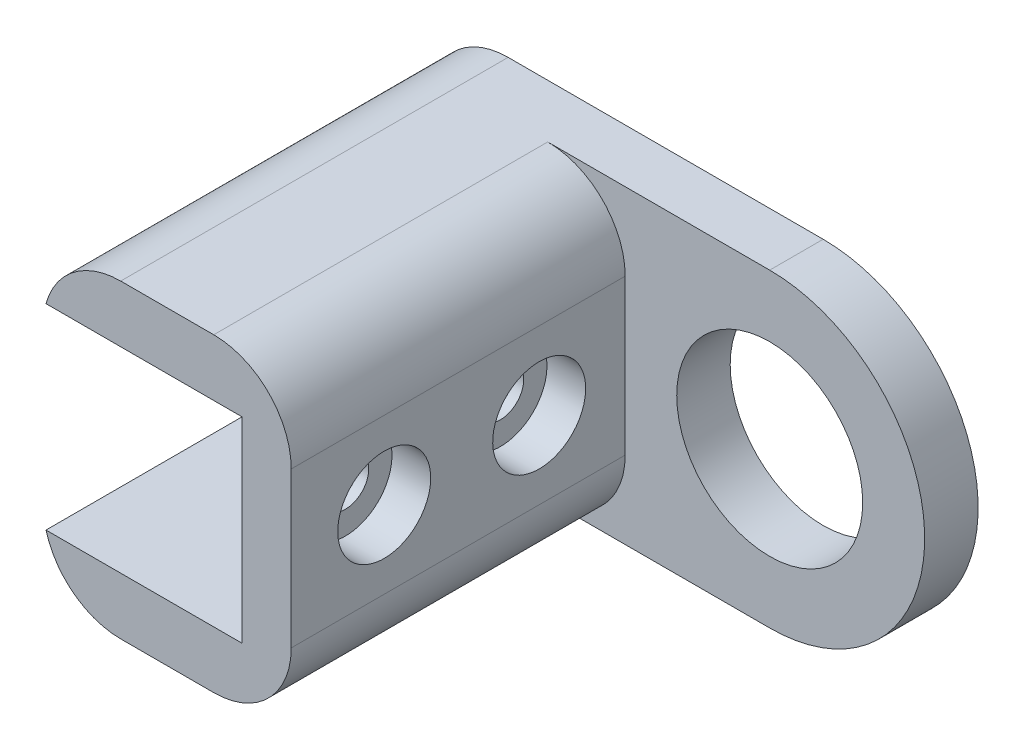
ISO-10303-21;
HEADER;
FILE_DESCRIPTION(('STEP AP214'),'2;1');
FILE_NAME('part.step','',(''),(''),'','','');
FILE_SCHEMA(('AUTOMOTIVE_DESIGN { 1 0 10303 214 1 1 1 1 }'));
ENDSEC;
DATA;
#1=APPLICATION_CONTEXT('core data for automotive mechanical design processes');
#2=APPLICATION_PROTOCOL_DEFINITION('international standard','automotive_design',2000,#1);
#3=PRODUCT_CONTEXT('',#1,'mechanical');
#4=PRODUCT('Part','Part','',(#3));
#5=PRODUCT_RELATED_PRODUCT_CATEGORY('part','',(#4));
#6=PRODUCT_DEFINITION_FORMATION('','',#4);
#7=PRODUCT_DEFINITION_CONTEXT('part definition',#1,'design');
#8=PRODUCT_DEFINITION('design','',#6,#7);
#9=PRODUCT_DEFINITION_SHAPE('','',#8);
#10=(LENGTH_UNIT() NAMED_UNIT(*) SI_UNIT(.MILLI.,.METRE.));
#11=(NAMED_UNIT(*) PLANE_ANGLE_UNIT() SI_UNIT($,.RADIAN.));
#12=(NAMED_UNIT(*) SI_UNIT($,.STERADIAN.) SOLID_ANGLE_UNIT());
#13=UNCERTAINTY_MEASURE_WITH_UNIT(LENGTH_MEASURE(1.E-05),#10,'distance_accuracy_value','');
#14=(GEOMETRIC_REPRESENTATION_CONTEXT(3) GLOBAL_UNCERTAINTY_ASSIGNED_CONTEXT((#13)) GLOBAL_UNIT_ASSIGNED_CONTEXT((#10,
#11,#12)) REPRESENTATION_CONTEXT('',''));
#15=CARTESIAN_POINT('',(0.,0.,0.));
#16=DIRECTION('',(0.,0.,1.));
#17=DIRECTION('',(1.,0.,0.));
#18=AXIS2_PLACEMENT_3D('',#15,#16,#17);
#19=CARTESIAN_POINT('',(-21.975,0.,9.));
#20=DIRECTION('',(1.,0.,0.));
#21=DIRECTION('',(0.,1.,0.));
#22=AXIS2_PLACEMENT_3D('',#19,#20,#21);
#23=CYLINDRICAL_SURFACE('',#22,1.5);
#24=CARTESIAN_POINT('',(-12.5,0.,9.));
#25=DIRECTION('',(1.,0.,0.));
#26=DIRECTION('',(0.,0.,-1.));
#27=AXIS2_PLACEMENT_3D('',#24,#25,#26);
#28=CIRCLE('',#27,1.5);
#29=CARTESIAN_POINT('',(-12.5,0.,7.5));
#30=VERTEX_POINT('',#29);
#31=EDGE_CURVE('E210',#30,#30,#28,.T.);
#32=ORIENTED_EDGE('',*,*,#31,.F.);
#33=EDGE_LOOP('',(#32));
#34=FACE_BOUND('',#33,.T.);
#35=CARTESIAN_POINT('',(-11.825,0.,9.));
#36=DIRECTION('',(1.,0.,0.));
#37=DIRECTION('',(0.,1.,0.));
#38=AXIS2_PLACEMENT_3D('',#35,#36,#37);
#39=CIRCLE('',#38,1.5);
#40=CARTESIAN_POINT('',(-11.825,1.5,9.));
#41=VERTEX_POINT('',#40);
#42=EDGE_CURVE('E212',#41,#41,#39,.F.);
#43=ORIENTED_EDGE('',*,*,#42,.F.);
#44=EDGE_LOOP('',(#43));
#45=FACE_BOUND('',#44,.T.);
#46=ADVANCED_FACE('F43',(#34,#45),#23,.F.);
#47=CARTESIAN_POINT('',(-21.975,0.,19.));
#48=DIRECTION('',(1.,0.,0.));
#49=DIRECTION('',(0.,1.,0.));
#50=AXIS2_PLACEMENT_3D('',#47,#48,#49);
#51=CYLINDRICAL_SURFACE('',#50,1.5);
#52=CARTESIAN_POINT('',(-12.5,0.,19.));
#53=DIRECTION('',(1.,0.,0.));
#54=DIRECTION('',(0.,0.,-1.));
#55=AXIS2_PLACEMENT_3D('',#52,#53,#54);
#56=CIRCLE('',#55,1.5);
#57=CARTESIAN_POINT('',(-12.5,0.,17.5));
#58=VERTEX_POINT('',#57);
#59=EDGE_CURVE('E153',#58,#58,#56,.T.);
#60=ORIENTED_EDGE('',*,*,#59,.F.);
#61=EDGE_LOOP('',(#60));
#62=FACE_BOUND('',#61,.T.);
#63=CARTESIAN_POINT('',(-11.825,0.,19.));
#64=DIRECTION('',(1.,0.,0.));
#65=DIRECTION('',(0.,1.,0.));
#66=AXIS2_PLACEMENT_3D('',#63,#64,#65);
#67=CIRCLE('',#66,1.5);
#68=CARTESIAN_POINT('',(-11.825,1.5,19.));
#69=VERTEX_POINT('',#68);
#70=EDGE_CURVE('E207',#69,#69,#67,.F.);
#71=ORIENTED_EDGE('',*,*,#70,.F.);
#72=EDGE_LOOP('',(#71));
#73=FACE_BOUND('',#72,.T.);
#74=ADVANCED_FACE('F309',(#62,#73),#51,.F.);
#75=CARTESIAN_POINT('',(-12.5,10.,3.45));
#76=DIRECTION('',(1.,0.,0.));
#77=DIRECTION('',(0.,0.,-1.));
#78=AXIS2_PLACEMENT_3D('',#75,#76,#77);
#79=PLANE('',#78);
#80=ORIENTED_EDGE('',*,*,#31,.T.);
#81=EDGE_LOOP('',(#80));
#82=FACE_BOUND('',#81,.T.);
#83=ORIENTED_EDGE('',*,*,#59,.T.);
#84=EDGE_LOOP('',(#83));
#85=FACE_BOUND('',#84,.T.);
#86=DIRECTION('',(0.,0.,-1.));
#87=VECTOR('',#86,1.);
#88=CARTESIAN_POINT('',(-12.5,-6.325,0.));
#89=LINE('',#88,#87);
#90=CARTESIAN_POINT('',(-12.5,-6.325,25.));
#91=VERTEX_POINT('',#90);
#92=CARTESIAN_POINT('',(-12.5,-6.325,0.));
#93=VERTEX_POINT('',#92);
#94=EDGE_CURVE('E150',#91,#93,#89,.T.);
#95=ORIENTED_EDGE('',*,*,#94,.F.);
#96=DIRECTION('',(0.,-1.,0.));
#97=VECTOR('',#96,1.);
#98=CARTESIAN_POINT('',(-12.5,10.,25.));
#99=LINE('',#98,#97);
#100=CARTESIAN_POINT('',(-12.5,6.325,25.));
#101=VERTEX_POINT('',#100);
#102=EDGE_CURVE('E141',#101,#91,#99,.T.);
#103=ORIENTED_EDGE('',*,*,#102,.F.);
#104=DIRECTION('',(0.,0.,1.));
#105=VECTOR('',#104,1.);
#106=CARTESIAN_POINT('',(-12.5,6.325,25.));
#107=LINE('',#106,#105);
#108=CARTESIAN_POINT('',(-12.5,6.325,0.));
#109=VERTEX_POINT('',#108);
#110=EDGE_CURVE('E144',#109,#101,#107,.T.);
#111=ORIENTED_EDGE('',*,*,#110,.F.);
#112=DIRECTION('',(0.,-1.,0.));
#113=VECTOR('',#112,1.);
#114=CARTESIAN_POINT('',(-12.5,10.,0.));
#115=LINE('',#114,#113);
#116=EDGE_CURVE('E234',#109,#93,#115,.T.);
#117=ORIENTED_EDGE('',*,*,#116,.T.);
#118=EDGE_LOOP('',(#95,#103,#111,#117));
#119=FACE_BOUND('',#118,.T.);
#120=ADVANCED_FACE('F315',(#82,#85,#119),#79,.F.);
#121=CARTESIAN_POINT('',(0.,0.,3.45));
#122=DIRECTION('',(0.,0.,1.));
#123=DIRECTION('',(1.,0.,0.));
#124=AXIS2_PLACEMENT_3D('',#121,#122,#123);
#125=PLANE('',#124);
#126=DIRECTION('',(0.,1.,0.));
#127=VECTOR('',#126,1.);
#128=CARTESIAN_POINT('',(-9.325,10.,3.45));
#129=LINE('',#128,#127);
#130=CARTESIAN_POINT('',(-9.325,-5.,3.45));
#131=VERTEX_POINT('',#130);
#132=CARTESIAN_POINT('',(-9.325,5.,3.45));
#133=VERTEX_POINT('',#132);
#134=EDGE_CURVE('E179',#131,#133,#129,.T.);
#135=ORIENTED_EDGE('',*,*,#134,.F.);
#136=CARTESIAN_POINT('',(-14.325,-5.,3.44999999999999));
#137=DIRECTION('',(0.,0.,1.));
#138=DIRECTION('',(1.,0.,0.));
#139=AXIS2_PLACEMENT_3D('',#136,#137,#138);
#140=CIRCLE('',#139,5.);
#141=CARTESIAN_POINT('',(-14.325,-10.,3.45));
#142=VERTEX_POINT('',#141);
#143=EDGE_CURVE('E203',#131,#142,#140,.F.);
#144=ORIENTED_EDGE('',*,*,#143,.T.);
#145=DIRECTION('',(1.,0.,0.));
#146=VECTOR('',#145,1.);
#147=CARTESIAN_POINT('',(-12.5,-10.,3.45));
#148=LINE('',#147,#146);
#149=CARTESIAN_POINT('',(0.,-10.,3.45));
#150=VERTEX_POINT('',#149);
#151=EDGE_CURVE('E245',#142,#150,#148,.T.);
#152=ORIENTED_EDGE('',*,*,#151,.T.);
#153=CARTESIAN_POINT('',(0.,0.,3.45));
#154=DIRECTION('',(0.,0.,1.));
#155=DIRECTION('',(1.,0.,0.));
#156=AXIS2_PLACEMENT_3D('',#153,#154,#155);
#157=CIRCLE('',#156,10.);
#158=CARTESIAN_POINT('',(0.,10.,3.45));
#159=VERTEX_POINT('',#158);
#160=EDGE_CURVE('E238',#150,#159,#157,.T.);
#161=ORIENTED_EDGE('',*,*,#160,.T.);
#162=DIRECTION('',(-1.,0.,0.));
#163=VECTOR('',#162,1.);
#164=CARTESIAN_POINT('',(0.,10.,3.45));
#165=LINE('',#164,#163);
#166=CARTESIAN_POINT('',(-14.325,10.,3.45));
#167=VERTEX_POINT('',#166);
#168=EDGE_CURVE('E255',#159,#167,#165,.T.);
#169=ORIENTED_EDGE('',*,*,#168,.T.);
#170=CARTESIAN_POINT('',(-14.325,5.,3.45));
#171=DIRECTION('',(0.,0.,1.));
#172=DIRECTION('',(1.,0.,0.));
#173=AXIS2_PLACEMENT_3D('',#170,#171,#172);
#174=CIRCLE('',#173,5.);
#175=EDGE_CURVE('E201',#167,#133,#174,.F.);
#176=ORIENTED_EDGE('',*,*,#175,.T.);
#177=EDGE_LOOP('',(#135,#144,#152,#161,#169,#176));
#178=FACE_BOUND('',#177,.T.);
#179=CARTESIAN_POINT('',(0.,0.,3.45));
#180=DIRECTION('',(0.,0.,1.));
#181=DIRECTION('',(1.,0.,0.));
#182=AXIS2_PLACEMENT_3D('',#179,#180,#181);
#183=CIRCLE('',#182,6.);
#184=CARTESIAN_POINT('',(-6.,0.,3.45));
#185=VERTEX_POINT('',#184);
#186=EDGE_CURVE('E262',#185,#185,#183,.T.);
#187=ORIENTED_EDGE('',*,*,#186,.F.);
#188=EDGE_LOOP('',(#187));
#189=FACE_BOUND('',#188,.T.);
#190=ADVANCED_FACE('F294',(#178,#189),#125,.T.);
#191=CARTESIAN_POINT('',(0.,0.,0.));
#192=DIRECTION('',(0.,0.,1.));
#193=DIRECTION('',(1.,0.,0.));
#194=AXIS2_PLACEMENT_3D('',#191,#192,#193);
#195=PLANE('',#194);
#196=DIRECTION('',(1.,0.,0.));
#197=VECTOR('',#196,1.);
#198=CARTESIAN_POINT('',(-25.15,6.325,0.));
#199=LINE('',#198,#197);
#200=CARTESIAN_POINT('',(-25.15,6.325,0.));
#201=VERTEX_POINT('',#200);
#202=EDGE_CURVE('E174',#201,#109,#199,.T.);
#203=ORIENTED_EDGE('',*,*,#202,.F.);
#204=CARTESIAN_POINT('',(-20.3287579401154,5.,0.));
#205=DIRECTION('',(0.,0.,1.));
#206=DIRECTION('',(1.,0.,0.));
#207=AXIS2_PLACEMENT_3D('',#204,#205,#206);
#208=CIRCLE('',#207,5.);
#209=CARTESIAN_POINT('',(-20.3287579401154,10.,0.));
#210=VERTEX_POINT('',#209);
#211=EDGE_CURVE('E219',#201,#210,#208,.F.);
#212=ORIENTED_EDGE('',*,*,#211,.T.);
#213=DIRECTION('',(-1.,0.,0.));
#214=VECTOR('',#213,1.);
#215=CARTESIAN_POINT('',(0.,10.,0.));
#216=LINE('',#215,#214);
#217=CARTESIAN_POINT('',(0.,10.,0.));
#218=VERTEX_POINT('',#217);
#219=EDGE_CURVE('E237',#218,#210,#216,.T.);
#220=ORIENTED_EDGE('',*,*,#219,.F.);
#221=CARTESIAN_POINT('',(0.,0.,0.));
#222=DIRECTION('',(0.,0.,1.));
#223=DIRECTION('',(1.,0.,0.));
#224=AXIS2_PLACEMENT_3D('',#221,#222,#223);
#225=CIRCLE('',#224,10.);
#226=CARTESIAN_POINT('',(0.,-10.,0.));
#227=VERTEX_POINT('',#226);
#228=EDGE_CURVE('E241',#227,#218,#225,.T.);
#229=ORIENTED_EDGE('',*,*,#228,.F.);
#230=DIRECTION('',(1.,0.,0.));
#231=VECTOR('',#230,1.);
#232=CARTESIAN_POINT('',(-12.5,-10.,0.));
#233=LINE('',#232,#231);
#234=CARTESIAN_POINT('',(-20.3287579401154,-10.,0.));
#235=VERTEX_POINT('',#234);
#236=EDGE_CURVE('E236',#235,#227,#233,.T.);
#237=ORIENTED_EDGE('',*,*,#236,.F.);
#238=CARTESIAN_POINT('',(-20.3287579401154,-5.,0.));
#239=DIRECTION('',(0.,0.,1.));
#240=DIRECTION('',(1.,0.,0.));
#241=AXIS2_PLACEMENT_3D('',#238,#239,#240);
#242=CIRCLE('',#241,5.);
#243=CARTESIAN_POINT('',(-25.15,-6.325,0.));
#244=VERTEX_POINT('',#243);
#245=EDGE_CURVE('E206',#235,#244,#242,.F.);
#246=ORIENTED_EDGE('',*,*,#245,.T.);
#247=DIRECTION('',(1.,0.,0.));
#248=VECTOR('',#247,1.);
#249=CARTESIAN_POINT('',(-25.15,-6.325,0.));
#250=LINE('',#249,#248);
#251=EDGE_CURVE('E145',#244,#93,#250,.T.);
#252=ORIENTED_EDGE('',*,*,#251,.T.);
#253=ORIENTED_EDGE('',*,*,#116,.F.);
#254=EDGE_LOOP('',(#203,#212,#220,#229,#237,#246,#252,#253));
#255=FACE_BOUND('',#254,.T.);
#256=CARTESIAN_POINT('',(0.,0.,0.));
#257=DIRECTION('',(0.,0.,1.));
#258=DIRECTION('',(1.,0.,0.));
#259=AXIS2_PLACEMENT_3D('',#256,#257,#258);
#260=CIRCLE('',#259,6.);
#261=CARTESIAN_POINT('',(-6.,0.,0.));
#262=VERTEX_POINT('',#261);
#263=EDGE_CURVE('E267',#262,#262,#260,.T.);
#264=ORIENTED_EDGE('',*,*,#263,.T.);
#265=EDGE_LOOP('',(#264));
#266=FACE_BOUND('',#265,.T.);
#267=ADVANCED_FACE('F231',(#255,#266),#195,.F.);
#268=CARTESIAN_POINT('',(0.,0.,3.45));
#269=DIRECTION('',(0.,0.,-1.));
#270=DIRECTION('',(-1.,0.,0.));
#271=AXIS2_PLACEMENT_3D('',#268,#269,#270);
#272=CYLINDRICAL_SURFACE('',#271,10.);
#273=ORIENTED_EDGE('',*,*,#228,.T.);
#274=DIRECTION('',(0.,0.,-1.));
#275=VECTOR('',#274,1.);
#276=CARTESIAN_POINT('',(0.,10.,3.45));
#277=LINE('',#276,#275);
#278=EDGE_CURVE('E186',#159,#218,#277,.T.);
#279=ORIENTED_EDGE('',*,*,#278,.F.);
#280=ORIENTED_EDGE('',*,*,#160,.F.);
#281=DIRECTION('',(0.,0.,-1.));
#282=VECTOR('',#281,1.);
#283=CARTESIAN_POINT('',(0.,-10.,3.45));
#284=LINE('',#283,#282);
#285=EDGE_CURVE('E251',#150,#227,#284,.T.);
#286=ORIENTED_EDGE('',*,*,#285,.T.);
#287=EDGE_LOOP('',(#273,#279,#280,#286));
#288=FACE_BOUND('',#287,.T.);
#289=ADVANCED_FACE('F297',(#288),#272,.T.);
#290=CARTESIAN_POINT('',(0.,10.,3.45));
#291=DIRECTION('',(0.,-1.,0.));
#292=DIRECTION('',(0.,0.,-1.));
#293=AXIS2_PLACEMENT_3D('',#290,#291,#292);
#294=PLANE('',#293);
#295=ORIENTED_EDGE('',*,*,#219,.T.);
#296=DIRECTION('',(0.,0.,1.));
#297=VECTOR('',#296,1.);
#298=CARTESIAN_POINT('',(-20.3287579401154,10.,3.45));
#299=LINE('',#298,#297);
#300=CARTESIAN_POINT('',(-20.3287579401154,10.,25.));
#301=VERTEX_POINT('',#300);
#302=EDGE_CURVE('E66',#210,#301,#299,.T.);
#303=ORIENTED_EDGE('',*,*,#302,.T.);
#304=DIRECTION('',(-1.,0.,0.));
#305=VECTOR('',#304,1.);
#306=CARTESIAN_POINT('',(-12.5,10.,25.));
#307=LINE('',#306,#305);
#308=CARTESIAN_POINT('',(-14.325,10.,25.));
#309=VERTEX_POINT('',#308);
#310=EDGE_CURVE('E189',#309,#301,#307,.T.);
#311=ORIENTED_EDGE('',*,*,#310,.F.);
#312=DIRECTION('',(0.,0.,-1.));
#313=VECTOR('',#312,1.);
#314=CARTESIAN_POINT('',(-14.325,10.,3.45));
#315=LINE('',#314,#313);
#316=EDGE_CURVE('E182',#309,#167,#315,.T.);
#317=ORIENTED_EDGE('',*,*,#316,.T.);
#318=ORIENTED_EDGE('',*,*,#168,.F.);
#319=ORIENTED_EDGE('',*,*,#278,.T.);
#320=EDGE_LOOP('',(#295,#303,#311,#317,#318,#319));
#321=FACE_BOUND('',#320,.T.);
#322=ADVANCED_FACE('F289',(#321),#294,.F.);
#323=CARTESIAN_POINT('',(-12.5,-10.,3.45));
#324=DIRECTION('',(0.,1.,0.));
#325=DIRECTION('',(0.,0.,1.));
#326=AXIS2_PLACEMENT_3D('',#323,#324,#325);
#327=PLANE('',#326);
#328=DIRECTION('',(1.,0.,0.));
#329=VECTOR('',#328,1.);
#330=CARTESIAN_POINT('',(-12.5,-10.,25.));
#331=LINE('',#330,#329);
#332=CARTESIAN_POINT('',(-20.3287579401154,-10.,25.));
#333=VERTEX_POINT('',#332);
#334=CARTESIAN_POINT('',(-14.325,-10.,25.));
#335=VERTEX_POINT('',#334);
#336=EDGE_CURVE('E277',#333,#335,#331,.T.);
#337=ORIENTED_EDGE('',*,*,#336,.F.);
#338=DIRECTION('',(0.,0.,1.));
#339=VECTOR('',#338,1.);
#340=CARTESIAN_POINT('',(-20.3287579401154,-10.,3.45));
#341=LINE('',#340,#339);
#342=EDGE_CURVE('E13',#333,#235,#341,.F.);
#343=ORIENTED_EDGE('',*,*,#342,.T.);
#344=ORIENTED_EDGE('',*,*,#236,.T.);
#345=ORIENTED_EDGE('',*,*,#285,.F.);
#346=ORIENTED_EDGE('',*,*,#151,.F.);
#347=DIRECTION('',(0.,0.,-1.));
#348=VECTOR('',#347,1.);
#349=CARTESIAN_POINT('',(-14.325,-10.,3.45));
#350=LINE('',#349,#348);
#351=EDGE_CURVE('E198',#142,#335,#350,.F.);
#352=ORIENTED_EDGE('',*,*,#351,.T.);
#353=EDGE_LOOP('',(#337,#343,#344,#345,#346,#352));
#354=FACE_BOUND('',#353,.T.);
#355=ADVANCED_FACE('F304',(#354),#327,.F.);
#356=CARTESIAN_POINT('',(0.,0.,3.45));
#357=DIRECTION('',(0.,0.,-1.));
#358=DIRECTION('',(-1.,0.,0.));
#359=AXIS2_PLACEMENT_3D('',#356,#357,#358);
#360=CYLINDRICAL_SURFACE('',#359,6.);
#361=CARTESIAN_POINT('',(-6.,0.,3.45));
#362=CARTESIAN_POINT('',(-6.,0.,3.4140625));
#363=CARTESIAN_POINT('',(-6.,0.,3.378125));
#364=CARTESIAN_POINT('',(-6.,0.,3.30625));
#365=CARTESIAN_POINT('',(-6.,0.,3.2703125));
#366=CARTESIAN_POINT('',(-6.,0.,3.1984375));
#367=CARTESIAN_POINT('',(-6.,0.,3.1625));
#368=CARTESIAN_POINT('',(-6.,0.,3.090625));
#369=CARTESIAN_POINT('',(-6.,0.,3.0546875));
#370=CARTESIAN_POINT('',(-6.,0.,2.9828125));
#371=CARTESIAN_POINT('',(-6.,0.,2.946875));
#372=CARTESIAN_POINT('',(-6.,0.,2.875));
#373=CARTESIAN_POINT('',(-6.,0.,2.8390625));
#374=CARTESIAN_POINT('',(-6.,0.,2.7671875));
#375=CARTESIAN_POINT('',(-6.,0.,2.73125));
#376=CARTESIAN_POINT('',(-6.,0.,2.659375));
#377=CARTESIAN_POINT('',(-6.,0.,2.6234375));
#378=CARTESIAN_POINT('',(-6.,0.,2.5515625));
#379=CARTESIAN_POINT('',(-6.,0.,2.515625));
#380=CARTESIAN_POINT('',(-6.,0.,2.44375));
#381=CARTESIAN_POINT('',(-6.,0.,2.4078125));
#382=CARTESIAN_POINT('',(-6.,0.,2.3359375));
#383=CARTESIAN_POINT('',(-6.,0.,2.3));
#384=CARTESIAN_POINT('',(-6.,0.,2.228125));
#385=CARTESIAN_POINT('',(-6.,0.,2.1921875));
#386=CARTESIAN_POINT('',(-6.,0.,2.1203125));
#387=CARTESIAN_POINT('',(-6.,0.,2.084375));
#388=CARTESIAN_POINT('',(-6.,0.,2.0125));
#389=CARTESIAN_POINT('',(-6.,0.,1.9765625));
#390=CARTESIAN_POINT('',(-6.,0.,1.9046875));
#391=CARTESIAN_POINT('',(-6.,0.,1.86875));
#392=CARTESIAN_POINT('',(-6.,0.,1.796875));
#393=CARTESIAN_POINT('',(-6.,0.,1.7609375));
#394=CARTESIAN_POINT('',(-6.,0.,1.6890625));
#395=CARTESIAN_POINT('',(-6.,0.,1.653125));
#396=CARTESIAN_POINT('',(-6.,0.,1.58125));
#397=CARTESIAN_POINT('',(-6.,0.,1.5453125));
#398=CARTESIAN_POINT('',(-6.,0.,1.4734375));
#399=CARTESIAN_POINT('',(-6.,0.,1.4375));
#400=CARTESIAN_POINT('',(-6.,0.,1.365625));
#401=CARTESIAN_POINT('',(-6.,0.,1.3296875));
#402=CARTESIAN_POINT('',(-6.,0.,1.2578125));
#403=CARTESIAN_POINT('',(-6.,0.,1.221875));
#404=CARTESIAN_POINT('',(-6.,0.,1.15));
#405=CARTESIAN_POINT('',(-6.,0.,1.1140625));
#406=CARTESIAN_POINT('',(-6.,0.,1.0421875));
#407=CARTESIAN_POINT('',(-6.,0.,1.00625));
#408=CARTESIAN_POINT('',(-6.,0.,0.934375));
#409=CARTESIAN_POINT('',(-6.,0.,0.8984375));
#410=CARTESIAN_POINT('',(-6.,0.,0.8265625));
#411=CARTESIAN_POINT('',(-6.,0.,0.790625));
#412=CARTESIAN_POINT('',(-6.,0.,0.71875));
#413=CARTESIAN_POINT('',(-6.,0.,0.6828125));
#414=CARTESIAN_POINT('',(-6.,0.,0.6109375));
#415=CARTESIAN_POINT('',(-6.,0.,0.575));
#416=CARTESIAN_POINT('',(-6.,0.,0.503125));
#417=CARTESIAN_POINT('',(-6.,0.,0.4671875));
#418=CARTESIAN_POINT('',(-6.,0.,0.3953125));
#419=CARTESIAN_POINT('',(-6.,0.,0.359375));
#420=CARTESIAN_POINT('',(-6.,0.,0.2875));
#421=CARTESIAN_POINT('',(-6.,0.,0.2515625));
#422=CARTESIAN_POINT('',(-6.,0.,0.1796875));
#423=CARTESIAN_POINT('',(-6.,0.,0.14375));
#424=CARTESIAN_POINT('',(-6.,0.,0.0718749999999999));
#425=CARTESIAN_POINT('',(-6.,0.,0.0359374999999999));
#426=CARTESIAN_POINT('',(-6.,0.,0.));
#427=B_SPLINE_CURVE_WITH_KNOTS('',3,(#361,#362,#363,#364,#365,#366,#367,#368,#369,#370,#371,
#372,#373,#374,#375,#376,#377,#378,#379,#380,#381,#382,#383,#384,#385,#386,#387,#388,#389,#390,
#391,#392,#393,#394,#395,#396,#397,#398,#399,#400,#401,#402,#403,#404,#405,#406,#407,#408,#409,
#410,#411,#412,#413,#414,#415,#416,#417,#418,#419,#420,#421,#422,#423,#424,#425,#426),
.UNSPECIFIED.,.F.,.F.,(4,2,2,2,2,2,2,2,2,2,2,2,2,2,2,2,2,2,2,2,2,2,2,2,2,2,2,2,2,2,2,2,4),(0.,
0.1078125,0.215625,0.3234375,0.43125,0.5390625,0.646875,0.7546875,0.8625,0.9703125,1.078125,
1.1859375,1.29375,1.4015625,1.509375,1.6171875,1.725,1.8328125,1.940625,2.0484375,2.15625,
2.2640625,2.371875,2.4796875,2.5875,2.6953125,2.803125,2.9109375,3.01875,3.1265625,3.234375,
3.3421875,3.45),.UNSPECIFIED.);
#428=EDGE_CURVE('BSEAM331',#185,#262,#427,.T.);
#429=ORIENTED_EDGE('',*,*,#186,.T.);
#430=ORIENTED_EDGE('',*,*,#263,.F.);
#431=ORIENTED_EDGE('',*,*,#428,.T.);
#432=ORIENTED_EDGE('',*,*,#428,.F.);
#433=EDGE_LOOP('',(#429,#431,#430,#432));
#434=FACE_BOUND('',#433,.T.);
#435=ADVANCED_FACE('F331',(#434),#360,.F.);
#436=CARTESIAN_POINT('',(-9.325,10.,70.250447525919));
#437=DIRECTION('',(-1.,0.,0.));
#438=DIRECTION('',(0.,-1.,0.));
#439=AXIS2_PLACEMENT_3D('',#436,#437,#438);
#440=PLANE('',#439);
#441=CARTESIAN_POINT('',(-9.325,0.,9.));
#442=DIRECTION('',(1.,0.,0.));
#443=DIRECTION('',(0.,1.,0.));
#444=AXIS2_PLACEMENT_3D('',#441,#442,#443);
#445=CIRCLE('',#444,3.);
#446=CARTESIAN_POINT('',(-9.325,3.,9.));
#447=VERTEX_POINT('',#446);
#448=EDGE_CURVE('E356',#447,#447,#445,.T.);
#449=ORIENTED_EDGE('',*,*,#448,.F.);
#450=EDGE_LOOP('',(#449));
#451=FACE_BOUND('',#450,.T.);
#452=CARTESIAN_POINT('',(-9.325,0.,19.));
#453=DIRECTION('',(1.,0.,0.));
#454=DIRECTION('',(0.,1.,0.));
#455=AXIS2_PLACEMENT_3D('',#452,#453,#454);
#456=CIRCLE('',#455,3.);
#457=CARTESIAN_POINT('',(-9.325,3.,19.));
#458=VERTEX_POINT('',#457);
#459=EDGE_CURVE('E215',#458,#458,#456,.T.);
#460=ORIENTED_EDGE('',*,*,#459,.F.);
#461=EDGE_LOOP('',(#460));
#462=FACE_BOUND('',#461,.T.);
#463=ORIENTED_EDGE('',*,*,#134,.T.);
#464=DIRECTION('',(0.,0.,-1.));
#465=VECTOR('',#464,1.);
#466=CARTESIAN_POINT('',(-9.325,5.,70.250447525919));
#467=LINE('',#466,#465);
#468=CARTESIAN_POINT('',(-9.325,5.,25.));
#469=VERTEX_POINT('',#468);
#470=EDGE_CURVE('E192',#133,#469,#467,.F.);
#471=ORIENTED_EDGE('',*,*,#470,.T.);
#472=DIRECTION('',(0.,1.,0.));
#473=VECTOR('',#472,1.);
#474=CARTESIAN_POINT('',(-9.325,10.,25.));
#475=LINE('',#474,#473);
#476=CARTESIAN_POINT('',(-9.325,-5.,25.));
#477=VERTEX_POINT('',#476);
#478=EDGE_CURVE('E273',#477,#469,#475,.T.);
#479=ORIENTED_EDGE('',*,*,#478,.F.);
#480=DIRECTION('',(0.,0.,-1.));
#481=VECTOR('',#480,1.);
#482=CARTESIAN_POINT('',(-9.325,-5.,70.250447525919));
#483=LINE('',#482,#481);
#484=EDGE_CURVE('E185',#477,#131,#483,.T.);
#485=ORIENTED_EDGE('',*,*,#484,.T.);
#486=EDGE_LOOP('',(#463,#471,#479,#485));
#487=FACE_BOUND('',#486,.T.);
#488=ADVANCED_FACE('F328',(#451,#462,#487),#440,.F.);
#489=CARTESIAN_POINT('',(0.,0.,25.));
#490=DIRECTION('',(0.,0.,1.));
#491=DIRECTION('',(1.,0.,0.));
#492=AXIS2_PLACEMENT_3D('',#489,#490,#491);
#493=PLANE('',#492);
#494=ORIENTED_EDGE('',*,*,#310,.T.);
#495=CARTESIAN_POINT('',(-20.3287579401154,5.,25.));
#496=DIRECTION('',(0.,0.,1.));
#497=DIRECTION('',(1.,0.,0.));
#498=AXIS2_PLACEMENT_3D('',#495,#496,#497);
#499=CIRCLE('',#498,5.);
#500=CARTESIAN_POINT('',(-25.15,6.325,25.));
#501=VERTEX_POINT('',#500);
#502=EDGE_CURVE('E51',#301,#501,#499,.T.);
#503=ORIENTED_EDGE('',*,*,#502,.T.);
#504=DIRECTION('',(1.,0.,0.));
#505=VECTOR('',#504,1.);
#506=CARTESIAN_POINT('',(-25.15,6.325,25.));
#507=LINE('',#506,#505);
#508=EDGE_CURVE('E161',#501,#101,#507,.T.);
#509=ORIENTED_EDGE('',*,*,#508,.T.);
#510=ORIENTED_EDGE('',*,*,#102,.T.);
#511=DIRECTION('',(1.,0.,0.));
#512=VECTOR('',#511,1.);
#513=CARTESIAN_POINT('',(-25.15,-6.325,25.));
#514=LINE('',#513,#512);
#515=CARTESIAN_POINT('',(-25.15,-6.325,25.));
#516=VERTEX_POINT('',#515);
#517=EDGE_CURVE('E138',#516,#91,#514,.T.);
#518=ORIENTED_EDGE('',*,*,#517,.F.);
#519=CARTESIAN_POINT('',(-20.3287579401154,-4.99999999999999,25.));
#520=DIRECTION('',(0.,0.,1.));
#521=DIRECTION('',(1.,0.,0.));
#522=AXIS2_PLACEMENT_3D('',#519,#520,#521);
#523=CIRCLE('',#522,5.);
#524=EDGE_CURVE('E58',#516,#333,#523,.T.);
#525=ORIENTED_EDGE('',*,*,#524,.T.);
#526=ORIENTED_EDGE('',*,*,#336,.T.);
#527=CARTESIAN_POINT('',(-14.325,-5.,25.));
#528=DIRECTION('',(0.,0.,1.));
#529=DIRECTION('',(1.,0.,0.));
#530=AXIS2_PLACEMENT_3D('',#527,#528,#529);
#531=CIRCLE('',#530,5.);
#532=EDGE_CURVE('E194',#335,#477,#531,.T.);
#533=ORIENTED_EDGE('',*,*,#532,.T.);
#534=ORIENTED_EDGE('',*,*,#478,.T.);
#535=CARTESIAN_POINT('',(-14.325,5.,25.));
#536=DIRECTION('',(0.,0.,1.));
#537=DIRECTION('',(1.,0.,0.));
#538=AXIS2_PLACEMENT_3D('',#535,#536,#537);
#539=CIRCLE('',#538,5.);
#540=EDGE_CURVE('E196',#469,#309,#539,.T.);
#541=ORIENTED_EDGE('',*,*,#540,.T.);
#542=EDGE_LOOP('',(#494,#503,#509,#510,#518,#525,#526,#533,#534,#541));
#543=FACE_BOUND('',#542,.T.);
#544=ADVANCED_FACE('F139',(#543),#493,.T.);
#545=CARTESIAN_POINT('',(-25.15,6.325,25.));
#546=DIRECTION('',(0.,1.,0.));
#547=DIRECTION('',(0.,0.,1.));
#548=AXIS2_PLACEMENT_3D('',#545,#546,#547);
#549=PLANE('',#548);
#550=ORIENTED_EDGE('',*,*,#110,.T.);
#551=ORIENTED_EDGE('',*,*,#508,.F.);
#552=DIRECTION('',(0.,0.,1.));
#553=VECTOR('',#552,1.);
#554=CARTESIAN_POINT('',(-25.15,6.325,25.));
#555=LINE('',#554,#553);
#556=EDGE_CURVE('E158',#201,#501,#555,.T.);
#557=ORIENTED_EDGE('',*,*,#556,.F.);
#558=ORIENTED_EDGE('',*,*,#202,.T.);
#559=EDGE_LOOP('',(#550,#551,#557,#558));
#560=FACE_BOUND('',#559,.T.);
#561=ADVANCED_FACE('F226',(#560),#549,.F.);
#562=CARTESIAN_POINT('',(-25.15,-6.325,0.));
#563=DIRECTION('',(0.,-1.,0.));
#564=DIRECTION('',(0.,0.,-1.));
#565=AXIS2_PLACEMENT_3D('',#562,#563,#564);
#566=PLANE('',#565);
#567=ORIENTED_EDGE('',*,*,#94,.T.);
#568=ORIENTED_EDGE('',*,*,#251,.F.);
#569=DIRECTION('',(0.,0.,-1.));
#570=VECTOR('',#569,1.);
#571=CARTESIAN_POINT('',(-25.15,-6.325,0.));
#572=LINE('',#571,#570);
#573=EDGE_CURVE('E135',#516,#244,#572,.T.);
#574=ORIENTED_EDGE('',*,*,#573,.F.);
#575=ORIENTED_EDGE('',*,*,#517,.T.);
#576=EDGE_LOOP('',(#567,#568,#574,#575));
#577=FACE_BOUND('',#576,.T.);
#578=ADVANCED_FACE('F148',(#577),#566,.F.);
#579=CARTESIAN_POINT('',(-14.325,5.,3.45));
#580=DIRECTION('',(0.,0.,-1.));
#581=DIRECTION('',(-1.,0.,0.));
#582=AXIS2_PLACEMENT_3D('',#579,#580,#581);
#583=CYLINDRICAL_SURFACE('',#582,5.);
#584=ORIENTED_EDGE('',*,*,#540,.F.);
#585=ORIENTED_EDGE('',*,*,#470,.F.);
#586=ORIENTED_EDGE('',*,*,#175,.F.);
#587=ORIENTED_EDGE('',*,*,#316,.F.);
#588=EDGE_LOOP('',(#584,#585,#586,#587));
#589=FACE_BOUND('',#588,.T.);
#590=ADVANCED_FACE('F287',(#589),#583,.T.);
#591=CARTESIAN_POINT('',(-14.325,-5.,70.250447525919));
#592=DIRECTION('',(0.,0.,-1.));
#593=DIRECTION('',(-1.,0.,0.));
#594=AXIS2_PLACEMENT_3D('',#591,#592,#593);
#595=CYLINDRICAL_SURFACE('',#594,5.);
#596=ORIENTED_EDGE('',*,*,#532,.F.);
#597=ORIENTED_EDGE('',*,*,#351,.F.);
#598=ORIENTED_EDGE('',*,*,#143,.F.);
#599=ORIENTED_EDGE('',*,*,#484,.F.);
#600=EDGE_LOOP('',(#596,#597,#598,#599));
#601=FACE_BOUND('',#600,.T.);
#602=ADVANCED_FACE('F374',(#601),#595,.T.);
#603=CARTESIAN_POINT('',(-11.825,0.,19.));
#604=DIRECTION('',(1.,0.,0.));
#605=DIRECTION('',(0.,1.,0.));
#606=AXIS2_PLACEMENT_3D('',#603,#604,#605);
#607=PLANE('',#606);
#608=CARTESIAN_POINT('',(-11.825,0.,19.));
#609=DIRECTION('',(1.,0.,0.));
#610=DIRECTION('',(0.,1.,0.));
#611=AXIS2_PLACEMENT_3D('',#608,#609,#610);
#612=CIRCLE('',#611,3.);
#613=CARTESIAN_POINT('',(-11.825,3.,19.));
#614=VERTEX_POINT('',#613);
#615=EDGE_CURVE('E211',#614,#614,#612,.T.);
#616=ORIENTED_EDGE('',*,*,#615,.T.);
#617=EDGE_LOOP('',(#616));
#618=FACE_BOUND('',#617,.T.);
#619=ORIENTED_EDGE('',*,*,#70,.T.);
#620=EDGE_LOOP('',(#619));
#621=FACE_BOUND('',#620,.T.);
#622=ADVANCED_FACE('F377',(#618,#621),#607,.T.);
#623=CARTESIAN_POINT('',(-11.825,0.,19.));
#624=DIRECTION('',(1.,0.,0.));
#625=DIRECTION('',(0.,1.,0.));
#626=AXIS2_PLACEMENT_3D('',#623,#624,#625);
#627=CYLINDRICAL_SURFACE('',#626,3.);
#628=ORIENTED_EDGE('',*,*,#615,.F.);
#629=EDGE_LOOP('',(#628));
#630=FACE_BOUND('',#629,.T.);
#631=ORIENTED_EDGE('',*,*,#459,.T.);
#632=EDGE_LOOP('',(#631));
#633=FACE_BOUND('',#632,.T.);
#634=ADVANCED_FACE('F321',(#630,#633),#627,.F.);
#635=CARTESIAN_POINT('',(-11.825,0.,9.));
#636=DIRECTION('',(1.,0.,0.));
#637=DIRECTION('',(0.,1.,0.));
#638=AXIS2_PLACEMENT_3D('',#635,#636,#637);
#639=PLANE('',#638);
#640=CARTESIAN_POINT('',(-11.825,0.,9.));
#641=DIRECTION('',(1.,0.,0.));
#642=DIRECTION('',(0.,1.,0.));
#643=AXIS2_PLACEMENT_3D('',#640,#641,#642);
#644=CIRCLE('',#643,3.);
#645=CARTESIAN_POINT('',(-11.825,3.,9.));
#646=VERTEX_POINT('',#645);
#647=EDGE_CURVE('E216',#646,#646,#644,.T.);
#648=ORIENTED_EDGE('',*,*,#647,.T.);
#649=EDGE_LOOP('',(#648));
#650=FACE_BOUND('',#649,.T.);
#651=ORIENTED_EDGE('',*,*,#42,.T.);
#652=EDGE_LOOP('',(#651));
#653=FACE_BOUND('',#652,.T.);
#654=ADVANCED_FACE('F362',(#650,#653),#639,.T.);
#655=CARTESIAN_POINT('',(-11.825,0.,9.));
#656=DIRECTION('',(1.,0.,0.));
#657=DIRECTION('',(0.,1.,0.));
#658=AXIS2_PLACEMENT_3D('',#655,#656,#657);
#659=CYLINDRICAL_SURFACE('',#658,3.);
#660=ORIENTED_EDGE('',*,*,#647,.F.);
#661=EDGE_LOOP('',(#660));
#662=FACE_BOUND('',#661,.T.);
#663=ORIENTED_EDGE('',*,*,#448,.T.);
#664=EDGE_LOOP('',(#663));
#665=FACE_BOUND('',#664,.T.);
#666=ADVANCED_FACE('F365',(#662,#665),#659,.F.);
#667=CARTESIAN_POINT('',(-20.3287579401154,5.,0.));
#668=DIRECTION('',(0.,0.,1.));
#669=DIRECTION('',(0.,-1.,0.));
#670=AXIS2_PLACEMENT_3D('',#667,#668,#669);
#671=CYLINDRICAL_SURFACE('',#670,5.);
#672=ORIENTED_EDGE('',*,*,#502,.F.);
#673=ORIENTED_EDGE('',*,*,#302,.F.);
#674=ORIENTED_EDGE('',*,*,#211,.F.);
#675=ORIENTED_EDGE('',*,*,#556,.T.);
#676=EDGE_LOOP('',(#672,#673,#674,#675));
#677=FACE_BOUND('',#676,.T.);
#678=ADVANCED_FACE('F227',(#677),#671,.T.);
#679=CARTESIAN_POINT('',(-20.3287579401154,-5.,0.));
#680=DIRECTION('',(0.,0.,1.));
#681=DIRECTION('',(0.,-1.,0.));
#682=AXIS2_PLACEMENT_3D('',#679,#680,#681);
#683=CYLINDRICAL_SURFACE('',#682,5.);
#684=ORIENTED_EDGE('',*,*,#245,.F.);
#685=ORIENTED_EDGE('',*,*,#342,.F.);
#686=ORIENTED_EDGE('',*,*,#524,.F.);
#687=ORIENTED_EDGE('',*,*,#573,.T.);
#688=EDGE_LOOP('',(#684,#685,#686,#687));
#689=FACE_BOUND('',#688,.T.);
#690=ADVANCED_FACE('F45',(#689),#683,.T.);
#691=CLOSED_SHELL('',(#46,#74,#120,#190,#267,#289,#322,#355,#435,#488,#544,#561,#578,#590,#602,
#622,#634,#654,#666,#678,#690));
#692=MANIFOLD_SOLID_BREP('B2',#691);
#693=ADVANCED_BREP_SHAPE_REPRESENTATION('',(#18,#692),#14);
#694=SHAPE_DEFINITION_REPRESENTATION(#9,#693);
ENDSEC;
END-ISO-10303-21;
